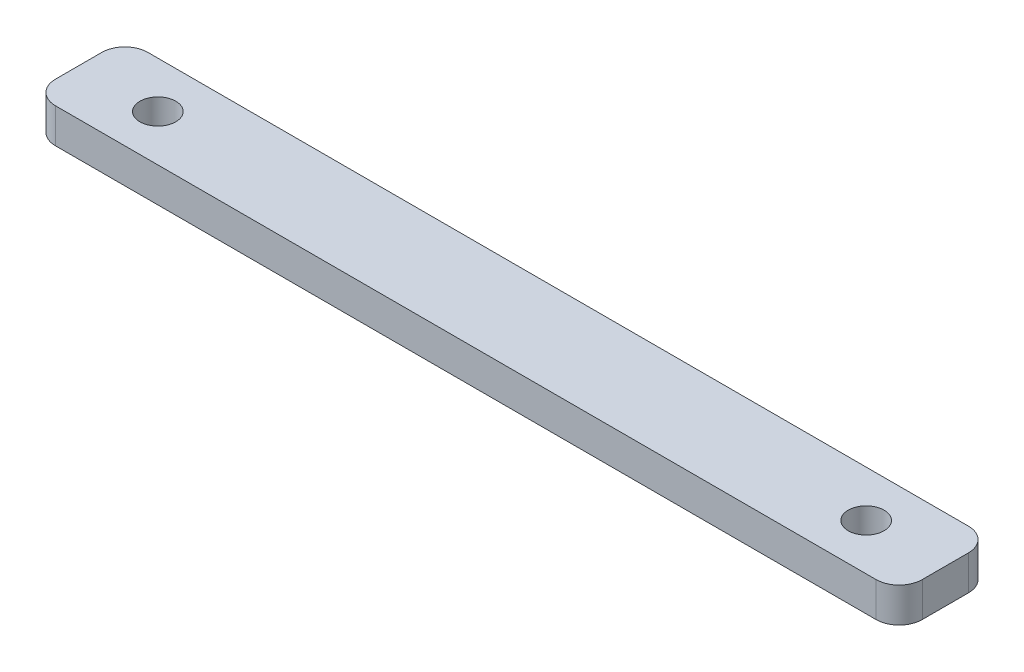
ISO-10303-21;
HEADER;
FILE_DESCRIPTION(('STEP AP214'),'2;1');
FILE_NAME('part.step','',(''),(''),'','','');
FILE_SCHEMA(('AUTOMOTIVE_DESIGN { 1 0 10303 214 1 1 1 1 }'));
ENDSEC;
DATA;
#1=APPLICATION_CONTEXT('core data for automotive mechanical design processes');
#2=APPLICATION_PROTOCOL_DEFINITION('international standard','automotive_design',2000,#1);
#3=PRODUCT_CONTEXT('',#1,'mechanical');
#4=PRODUCT('Part','Part','',(#3));
#5=PRODUCT_RELATED_PRODUCT_CATEGORY('part','',(#4));
#6=PRODUCT_DEFINITION_FORMATION('','',#4);
#7=PRODUCT_DEFINITION_CONTEXT('part definition',#1,'design');
#8=PRODUCT_DEFINITION('design','',#6,#7);
#9=PRODUCT_DEFINITION_SHAPE('','',#8);
#10=(LENGTH_UNIT() NAMED_UNIT(*) SI_UNIT(.MILLI.,.METRE.));
#11=(NAMED_UNIT(*) PLANE_ANGLE_UNIT() SI_UNIT($,.RADIAN.));
#12=(NAMED_UNIT(*) SI_UNIT($,.STERADIAN.) SOLID_ANGLE_UNIT());
#13=UNCERTAINTY_MEASURE_WITH_UNIT(LENGTH_MEASURE(1.E-05),#10,'distance_accuracy_value','');
#14=(GEOMETRIC_REPRESENTATION_CONTEXT(3) GLOBAL_UNCERTAINTY_ASSIGNED_CONTEXT((#13)) GLOBAL_UNIT_ASSIGNED_CONTEXT((#10,
#11,#12)) REPRESENTATION_CONTEXT('',''));
#15=CARTESIAN_POINT('',(0.,0.,0.));
#16=DIRECTION('',(0.,0.,1.));
#17=DIRECTION('',(1.,0.,0.));
#18=AXIS2_PLACEMENT_3D('',#15,#16,#17);
#19=CARTESIAN_POINT('',(0.,3.,0.));
#20=DIRECTION('',(0.,-1.,0.));
#21=DIRECTION('',(0.,0.,-1.));
#22=AXIS2_PLACEMENT_3D('',#19,#20,#21);
#23=PLANE('',#22);
#24=DIRECTION('',(1.,0.,0.));
#25=VECTOR('',#24,1.);
#26=CARTESIAN_POINT('',(37.5,3.,3.99999999999999));
#27=LINE('',#26,#25);
#28=CARTESIAN_POINT('',(-35.5,3.,4.));
#29=VERTEX_POINT('',#28);
#30=CARTESIAN_POINT('',(35.5,3.,3.99999999999999));
#31=VERTEX_POINT('',#30);
#32=EDGE_CURVE('E172',#29,#31,#27,.T.);
#33=ORIENTED_EDGE('',*,*,#32,.T.);
#34=CARTESIAN_POINT('',(35.5,3.,1.99999999999999));
#35=DIRECTION('',(0.,-1.,0.));
#36=DIRECTION('',(0.,0.,-1.));
#37=AXIS2_PLACEMENT_3D('',#34,#35,#36);
#38=CIRCLE('',#37,2.);
#39=CARTESIAN_POINT('',(37.5,3.,1.99999999999999));
#40=VERTEX_POINT('',#39);
#41=EDGE_CURVE('E153',#31,#40,#38,.F.);
#42=ORIENTED_EDGE('',*,*,#41,.T.);
#43=DIRECTION('',(0.,0.,-1.));
#44=VECTOR('',#43,1.);
#45=CARTESIAN_POINT('',(37.5,3.,-4.00000000000001));
#46=LINE('',#45,#44);
#47=CARTESIAN_POINT('',(37.5,3.,-2.));
#48=VERTEX_POINT('',#47);
#49=EDGE_CURVE('E123',#40,#48,#46,.T.);
#50=ORIENTED_EDGE('',*,*,#49,.T.);
#51=CARTESIAN_POINT('',(35.5,3.,-2.));
#52=DIRECTION('',(0.,-1.,0.));
#53=DIRECTION('',(0.,0.,-1.));
#54=AXIS2_PLACEMENT_3D('',#51,#52,#53);
#55=CIRCLE('',#54,2.);
#56=CARTESIAN_POINT('',(35.5,3.,-4.00000000000001));
#57=VERTEX_POINT('',#56);
#58=EDGE_CURVE('E59',#48,#57,#55,.F.);
#59=ORIENTED_EDGE('',*,*,#58,.T.);
#60=DIRECTION('',(-1.,0.,0.));
#61=VECTOR('',#60,1.);
#62=CARTESIAN_POINT('',(37.5,3.,-4.00000000000001));
#63=LINE('',#62,#61);
#64=CARTESIAN_POINT('',(-35.5,3.,-3.99999999999999));
#65=VERTEX_POINT('',#64);
#66=EDGE_CURVE('E139',#57,#65,#63,.T.);
#67=ORIENTED_EDGE('',*,*,#66,.T.);
#68=CARTESIAN_POINT('',(-35.5,3.,-1.99999999999999));
#69=DIRECTION('',(0.,-1.,0.));
#70=DIRECTION('',(0.,0.,-1.));
#71=AXIS2_PLACEMENT_3D('',#68,#69,#70);
#72=CIRCLE('',#71,2.);
#73=CARTESIAN_POINT('',(-37.5,3.,-1.99999999999999));
#74=VERTEX_POINT('',#73);
#75=EDGE_CURVE('E150',#65,#74,#72,.F.);
#76=ORIENTED_EDGE('',*,*,#75,.T.);
#77=DIRECTION('',(0.,0.,1.));
#78=VECTOR('',#77,1.);
#79=CARTESIAN_POINT('',(-37.5,3.,-3.99999999999999));
#80=LINE('',#79,#78);
#81=CARTESIAN_POINT('',(-37.5,3.,2.));
#82=VERTEX_POINT('',#81);
#83=EDGE_CURVE('E133',#74,#82,#80,.T.);
#84=ORIENTED_EDGE('',*,*,#83,.T.);
#85=CARTESIAN_POINT('',(-35.5,3.,2.));
#86=DIRECTION('',(0.,-1.,0.));
#87=DIRECTION('',(0.,0.,-1.));
#88=AXIS2_PLACEMENT_3D('',#85,#86,#87);
#89=CIRCLE('',#88,2.);
#90=EDGE_CURVE('E148',#82,#29,#89,.F.);
#91=ORIENTED_EDGE('',*,*,#90,.T.);
#92=EDGE_LOOP('',(#33,#42,#50,#59,#67,#76,#84,#91));
#93=FACE_BOUND('',#92,.T.);
#94=CARTESIAN_POINT('',(-30.645,3.,0.));
#95=DIRECTION('',(0.,1.,0.));
#96=DIRECTION('',(0.,0.,1.));
#97=AXIS2_PLACEMENT_3D('',#94,#95,#96);
#98=CIRCLE('',#97,1.55);
#99=CARTESIAN_POINT('',(-30.645,3.,1.55));
#100=VERTEX_POINT('',#99);
#101=EDGE_CURVE('E177',#100,#100,#98,.T.);
#102=ORIENTED_EDGE('',*,*,#101,.F.);
#103=EDGE_LOOP('',(#102));
#104=FACE_BOUND('',#103,.T.);
#105=CARTESIAN_POINT('',(30.645,3.,0.));
#106=DIRECTION('',(0.,1.,0.));
#107=DIRECTION('',(0.,0.,1.));
#108=AXIS2_PLACEMENT_3D('',#105,#106,#107);
#109=CIRCLE('',#108,1.55);
#110=CARTESIAN_POINT('',(30.645,3.,1.54999999999999));
#111=VERTEX_POINT('',#110);
#112=EDGE_CURVE('E186',#111,#111,#109,.T.);
#113=ORIENTED_EDGE('',*,*,#112,.F.);
#114=EDGE_LOOP('',(#113));
#115=FACE_BOUND('',#114,.T.);
#116=ADVANCED_FACE('F37',(#93,#104,#115),#23,.F.);
#117=CARTESIAN_POINT('',(0.,0.,0.));
#118=DIRECTION('',(0.,-1.,0.));
#119=DIRECTION('',(0.,0.,-1.));
#120=AXIS2_PLACEMENT_3D('',#117,#118,#119);
#121=PLANE('',#120);
#122=CARTESIAN_POINT('',(-30.645,0.,0.));
#123=DIRECTION('',(0.,1.,0.));
#124=DIRECTION('',(0.,0.,1.));
#125=AXIS2_PLACEMENT_3D('',#122,#123,#124);
#126=CIRCLE('',#125,1.55);
#127=CARTESIAN_POINT('',(-30.645,0.,1.55));
#128=VERTEX_POINT('',#127);
#129=EDGE_CURVE('E179',#128,#128,#126,.T.);
#130=ORIENTED_EDGE('',*,*,#129,.T.);
#131=EDGE_LOOP('',(#130));
#132=FACE_BOUND('',#131,.T.);
#133=DIRECTION('',(0.,0.,-1.));
#134=VECTOR('',#133,1.);
#135=CARTESIAN_POINT('',(37.5,0.,-4.00000000000001));
#136=LINE('',#135,#134);
#137=CARTESIAN_POINT('',(37.5,0.,1.99999999999999));
#138=VERTEX_POINT('',#137);
#139=CARTESIAN_POINT('',(37.5,0.,-2.));
#140=VERTEX_POINT('',#139);
#141=EDGE_CURVE('E121',#138,#140,#136,.T.);
#142=ORIENTED_EDGE('',*,*,#141,.F.);
#143=CARTESIAN_POINT('',(35.5,0.,1.99999999999999));
#144=DIRECTION('',(0.,-1.,0.));
#145=DIRECTION('',(0.,0.,-1.));
#146=AXIS2_PLACEMENT_3D('',#143,#144,#145);
#147=CIRCLE('',#146,2.);
#148=CARTESIAN_POINT('',(35.5,0.,3.99999999999999));
#149=VERTEX_POINT('',#148);
#150=EDGE_CURVE('E104',#138,#149,#147,.T.);
#151=ORIENTED_EDGE('',*,*,#150,.T.);
#152=DIRECTION('',(1.,0.,0.));
#153=VECTOR('',#152,1.);
#154=CARTESIAN_POINT('',(37.5,0.,3.99999999999999));
#155=LINE('',#154,#153);
#156=CARTESIAN_POINT('',(-35.5,0.,4.));
#157=VERTEX_POINT('',#156);
#158=EDGE_CURVE('E131',#157,#149,#155,.T.);
#159=ORIENTED_EDGE('',*,*,#158,.F.);
#160=CARTESIAN_POINT('',(-35.5,0.,2.));
#161=DIRECTION('',(0.,-1.,0.));
#162=DIRECTION('',(0.,0.,-1.));
#163=AXIS2_PLACEMENT_3D('',#160,#161,#162);
#164=CIRCLE('',#163,2.);
#165=CARTESIAN_POINT('',(-37.5,0.,2.));
#166=VERTEX_POINT('',#165);
#167=EDGE_CURVE('E124',#157,#166,#164,.T.);
#168=ORIENTED_EDGE('',*,*,#167,.T.);
#169=DIRECTION('',(0.,0.,1.));
#170=VECTOR('',#169,1.);
#171=CARTESIAN_POINT('',(-37.5,0.,-3.99999999999999));
#172=LINE('',#171,#170);
#173=CARTESIAN_POINT('',(-37.5,0.,-1.99999999999999));
#174=VERTEX_POINT('',#173);
#175=EDGE_CURVE('E135',#174,#166,#172,.T.);
#176=ORIENTED_EDGE('',*,*,#175,.F.);
#177=CARTESIAN_POINT('',(-35.5,0.,-1.99999999999999));
#178=DIRECTION('',(0.,-1.,0.));
#179=DIRECTION('',(0.,0.,-1.));
#180=AXIS2_PLACEMENT_3D('',#177,#178,#179);
#181=CIRCLE('',#180,2.);
#182=CARTESIAN_POINT('',(-35.5,0.,-3.99999999999999));
#183=VERTEX_POINT('',#182);
#184=EDGE_CURVE('E142',#174,#183,#181,.T.);
#185=ORIENTED_EDGE('',*,*,#184,.T.);
#186=DIRECTION('',(-1.,0.,0.));
#187=VECTOR('',#186,1.);
#188=CARTESIAN_POINT('',(37.5,0.,-4.00000000000001));
#189=LINE('',#188,#187);
#190=CARTESIAN_POINT('',(35.5,0.,-4.00000000000001));
#191=VERTEX_POINT('',#190);
#192=EDGE_CURVE('E130',#191,#183,#189,.T.);
#193=ORIENTED_EDGE('',*,*,#192,.F.);
#194=CARTESIAN_POINT('',(35.5,0.,-2.));
#195=DIRECTION('',(0.,-1.,0.));
#196=DIRECTION('',(0.,0.,-1.));
#197=AXIS2_PLACEMENT_3D('',#194,#195,#196);
#198=CIRCLE('',#197,2.);
#199=EDGE_CURVE('E115',#191,#140,#198,.T.);
#200=ORIENTED_EDGE('',*,*,#199,.T.);
#201=EDGE_LOOP('',(#142,#151,#159,#168,#176,#185,#193,#200));
#202=FACE_BOUND('',#201,.T.);
#203=CARTESIAN_POINT('',(30.645,0.,0.));
#204=DIRECTION('',(0.,1.,0.));
#205=DIRECTION('',(0.,0.,1.));
#206=AXIS2_PLACEMENT_3D('',#203,#204,#205);
#207=CIRCLE('',#206,1.55);
#208=CARTESIAN_POINT('',(30.645,0.,1.54999999999999));
#209=VERTEX_POINT('',#208);
#210=EDGE_CURVE('E188',#209,#209,#207,.T.);
#211=ORIENTED_EDGE('',*,*,#210,.T.);
#212=EDGE_LOOP('',(#211));
#213=FACE_BOUND('',#212,.T.);
#214=ADVANCED_FACE('F127',(#132,#202,#213),#121,.T.);
#215=CARTESIAN_POINT('',(-37.5,3.,-3.99999999999999));
#216=DIRECTION('',(1.,0.,0.));
#217=DIRECTION('',(0.,0.,-1.));
#218=AXIS2_PLACEMENT_3D('',#215,#216,#217);
#219=PLANE('',#218);
#220=ORIENTED_EDGE('',*,*,#83,.F.);
#221=DIRECTION('',(0.,-1.,0.));
#222=VECTOR('',#221,1.);
#223=CARTESIAN_POINT('',(-37.5,3.,-1.99999999999999));
#224=LINE('',#223,#222);
#225=EDGE_CURVE('E11',#74,#174,#224,.T.);
#226=ORIENTED_EDGE('',*,*,#225,.T.);
#227=ORIENTED_EDGE('',*,*,#175,.T.);
#228=DIRECTION('',(0.,-1.,0.));
#229=VECTOR('',#228,1.);
#230=CARTESIAN_POINT('',(-37.5,3.,2.));
#231=LINE('',#230,#229);
#232=EDGE_CURVE('E45',#166,#82,#231,.F.);
#233=ORIENTED_EDGE('',*,*,#232,.T.);
#234=EDGE_LOOP('',(#220,#226,#227,#233));
#235=FACE_BOUND('',#234,.T.);
#236=ADVANCED_FACE('F163',(#235),#219,.F.);
#237=CARTESIAN_POINT('',(37.5,3.,3.99999999999999));
#238=DIRECTION('',(0.,0.,-1.));
#239=DIRECTION('',(-1.,0.,0.));
#240=AXIS2_PLACEMENT_3D('',#237,#238,#239);
#241=PLANE('',#240);
#242=ORIENTED_EDGE('',*,*,#158,.T.);
#243=DIRECTION('',(0.,-1.,0.));
#244=VECTOR('',#243,1.);
#245=CARTESIAN_POINT('',(35.5,3.,3.99999999999999));
#246=LINE('',#245,#244);
#247=EDGE_CURVE('E109',#149,#31,#246,.F.);
#248=ORIENTED_EDGE('',*,*,#247,.T.);
#249=ORIENTED_EDGE('',*,*,#32,.F.);
#250=DIRECTION('',(0.,-1.,0.));
#251=VECTOR('',#250,1.);
#252=CARTESIAN_POINT('',(-35.5,3.,4.));
#253=LINE('',#252,#251);
#254=EDGE_CURVE('E114',#29,#157,#253,.T.);
#255=ORIENTED_EDGE('',*,*,#254,.T.);
#256=EDGE_LOOP('',(#242,#248,#249,#255));
#257=FACE_BOUND('',#256,.T.);
#258=ADVANCED_FACE('F176',(#257),#241,.F.);
#259=CARTESIAN_POINT('',(37.5,3.,-4.00000000000001));
#260=DIRECTION('',(-1.,0.,0.));
#261=DIRECTION('',(0.,0.,1.));
#262=AXIS2_PLACEMENT_3D('',#259,#260,#261);
#263=PLANE('',#262);
#264=ORIENTED_EDGE('',*,*,#49,.F.);
#265=DIRECTION('',(0.,-1.,0.));
#266=VECTOR('',#265,1.);
#267=CARTESIAN_POINT('',(37.5,3.,1.99999999999999));
#268=LINE('',#267,#266);
#269=EDGE_CURVE('E108',#40,#138,#268,.T.);
#270=ORIENTED_EDGE('',*,*,#269,.T.);
#271=ORIENTED_EDGE('',*,*,#141,.T.);
#272=DIRECTION('',(0.,-1.,0.));
#273=VECTOR('',#272,1.);
#274=CARTESIAN_POINT('',(37.5,3.,-2.));
#275=LINE('',#274,#273);
#276=EDGE_CURVE('E125',#140,#48,#275,.F.);
#277=ORIENTED_EDGE('',*,*,#276,.T.);
#278=EDGE_LOOP('',(#264,#270,#271,#277));
#279=FACE_BOUND('',#278,.T.);
#280=ADVANCED_FACE('F120',(#279),#263,.F.);
#281=CARTESIAN_POINT('',(37.5,3.,-4.00000000000001));
#282=DIRECTION('',(0.,0.,1.));
#283=DIRECTION('',(1.,0.,0.));
#284=AXIS2_PLACEMENT_3D('',#281,#282,#283);
#285=PLANE('',#284);
#286=ORIENTED_EDGE('',*,*,#66,.F.);
#287=DIRECTION('',(0.,-1.,0.));
#288=VECTOR('',#287,1.);
#289=CARTESIAN_POINT('',(35.5,3.,-4.00000000000001));
#290=LINE('',#289,#288);
#291=EDGE_CURVE('E156',#57,#191,#290,.T.);
#292=ORIENTED_EDGE('',*,*,#291,.T.);
#293=ORIENTED_EDGE('',*,*,#192,.T.);
#294=DIRECTION('',(0.,-1.,0.));
#295=VECTOR('',#294,1.);
#296=CARTESIAN_POINT('',(-35.5,3.,-3.99999999999999));
#297=LINE('',#296,#295);
#298=EDGE_CURVE('E52',#183,#65,#297,.F.);
#299=ORIENTED_EDGE('',*,*,#298,.T.);
#300=EDGE_LOOP('',(#286,#292,#293,#299));
#301=FACE_BOUND('',#300,.T.);
#302=ADVANCED_FACE('F208',(#301),#285,.F.);
#303=CARTESIAN_POINT('',(-30.645,3.,0.));
#304=DIRECTION('',(0.,-1.,0.));
#305=DIRECTION('',(0.,0.,-1.));
#306=AXIS2_PLACEMENT_3D('',#303,#304,#305);
#307=CYLINDRICAL_SURFACE('',#306,1.55);
#308=ORIENTED_EDGE('',*,*,#101,.T.);
#309=EDGE_LOOP('',(#308));
#310=FACE_BOUND('',#309,.T.);
#311=ORIENTED_EDGE('',*,*,#129,.F.);
#312=EDGE_LOOP('',(#311));
#313=FACE_BOUND('',#312,.T.);
#314=ADVANCED_FACE('F205',(#310,#313),#307,.F.);
#315=CARTESIAN_POINT('',(30.645,3.,0.));
#316=DIRECTION('',(0.,-1.,0.));
#317=DIRECTION('',(0.,0.,-1.));
#318=AXIS2_PLACEMENT_3D('',#315,#316,#317);
#319=CYLINDRICAL_SURFACE('',#318,1.55);
#320=ORIENTED_EDGE('',*,*,#112,.T.);
#321=EDGE_LOOP('',(#320));
#322=FACE_BOUND('',#321,.T.);
#323=ORIENTED_EDGE('',*,*,#210,.F.);
#324=EDGE_LOOP('',(#323));
#325=FACE_BOUND('',#324,.T.);
#326=ADVANCED_FACE('F194',(#322,#325),#319,.F.);
#327=CARTESIAN_POINT('',(35.5,3.,1.99999999999999));
#328=DIRECTION('',(0.,-1.,0.));
#329=DIRECTION('',(0.,0.,-1.));
#330=AXIS2_PLACEMENT_3D('',#327,#328,#329);
#331=CYLINDRICAL_SURFACE('',#330,2.);
#332=ORIENTED_EDGE('',*,*,#41,.F.);
#333=ORIENTED_EDGE('',*,*,#247,.F.);
#334=ORIENTED_EDGE('',*,*,#150,.F.);
#335=ORIENTED_EDGE('',*,*,#269,.F.);
#336=EDGE_LOOP('',(#332,#333,#334,#335));
#337=FACE_BOUND('',#336,.T.);
#338=ADVANCED_FACE('F107',(#337),#331,.T.);
#339=CARTESIAN_POINT('',(35.5,3.,-2.));
#340=DIRECTION('',(0.,-1.,0.));
#341=DIRECTION('',(0.,0.,-1.));
#342=AXIS2_PLACEMENT_3D('',#339,#340,#341);
#343=CYLINDRICAL_SURFACE('',#342,2.);
#344=ORIENTED_EDGE('',*,*,#58,.F.);
#345=ORIENTED_EDGE('',*,*,#276,.F.);
#346=ORIENTED_EDGE('',*,*,#199,.F.);
#347=ORIENTED_EDGE('',*,*,#291,.F.);
#348=EDGE_LOOP('',(#344,#345,#346,#347));
#349=FACE_BOUND('',#348,.T.);
#350=ADVANCED_FACE('F219',(#349),#343,.T.);
#351=CARTESIAN_POINT('',(-35.5,3.,-1.99999999999999));
#352=DIRECTION('',(0.,-1.,0.));
#353=DIRECTION('',(0.,0.,-1.));
#354=AXIS2_PLACEMENT_3D('',#351,#352,#353);
#355=CYLINDRICAL_SURFACE('',#354,2.);
#356=ORIENTED_EDGE('',*,*,#75,.F.);
#357=ORIENTED_EDGE('',*,*,#298,.F.);
#358=ORIENTED_EDGE('',*,*,#184,.F.);
#359=ORIENTED_EDGE('',*,*,#225,.F.);
#360=EDGE_LOOP('',(#356,#357,#358,#359));
#361=FACE_BOUND('',#360,.T.);
#362=ADVANCED_FACE('F221',(#361),#355,.T.);
#363=CARTESIAN_POINT('',(-35.5,3.,2.));
#364=DIRECTION('',(0.,-1.,0.));
#365=DIRECTION('',(0.,0.,-1.));
#366=AXIS2_PLACEMENT_3D('',#363,#364,#365);
#367=CYLINDRICAL_SURFACE('',#366,2.);
#368=ORIENTED_EDGE('',*,*,#90,.F.);
#369=ORIENTED_EDGE('',*,*,#232,.F.);
#370=ORIENTED_EDGE('',*,*,#167,.F.);
#371=ORIENTED_EDGE('',*,*,#254,.F.);
#372=EDGE_LOOP('',(#368,#369,#370,#371));
#373=FACE_BOUND('',#372,.T.);
#374=ADVANCED_FACE('F39',(#373),#367,.T.);
#375=CLOSED_SHELL('',(#116,#214,#236,#258,#280,#302,#314,#326,#338,#350,#362,#374));
#376=MANIFOLD_SOLID_BREP('B2',#375);
#377=ADVANCED_BREP_SHAPE_REPRESENTATION('',(#18,#376),#14);
#378=SHAPE_DEFINITION_REPRESENTATION(#9,#377);
ENDSEC;
END-ISO-10303-21;
